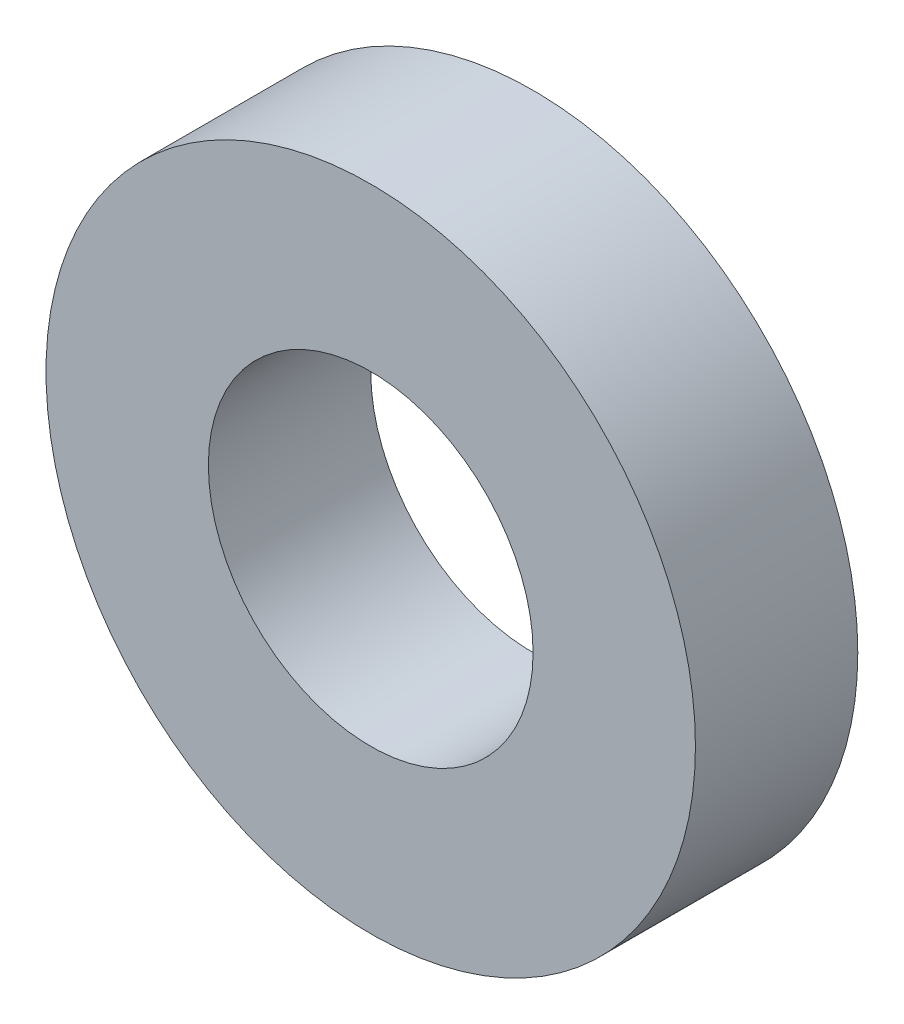
ISO-10303-21;
HEADER;
FILE_DESCRIPTION(('STEP AP214'),'2;1');
FILE_NAME('part.step','',(''),(''),'','','');
FILE_SCHEMA(('AUTOMOTIVE_DESIGN { 1 0 10303 214 1 1 1 1 }'));
ENDSEC;
DATA;
#1=APPLICATION_CONTEXT('core data for automotive mechanical design processes');
#2=APPLICATION_PROTOCOL_DEFINITION('international standard','automotive_design',2000,#1);
#3=PRODUCT_CONTEXT('',#1,'mechanical');
#4=PRODUCT('Part','Part','',(#3));
#5=PRODUCT_RELATED_PRODUCT_CATEGORY('part','',(#4));
#6=PRODUCT_DEFINITION_FORMATION('','',#4);
#7=PRODUCT_DEFINITION_CONTEXT('part definition',#1,'design');
#8=PRODUCT_DEFINITION('design','',#6,#7);
#9=PRODUCT_DEFINITION_SHAPE('','',#8);
#10=(LENGTH_UNIT() NAMED_UNIT(*) SI_UNIT(.MILLI.,.METRE.));
#11=(NAMED_UNIT(*) PLANE_ANGLE_UNIT() SI_UNIT($,.RADIAN.));
#12=(NAMED_UNIT(*) SI_UNIT($,.STERADIAN.) SOLID_ANGLE_UNIT());
#13=UNCERTAINTY_MEASURE_WITH_UNIT(LENGTH_MEASURE(1.E-05),#10,'distance_accuracy_value','');
#14=(GEOMETRIC_REPRESENTATION_CONTEXT(3) GLOBAL_UNCERTAINTY_ASSIGNED_CONTEXT((#13)) GLOBAL_UNIT_ASSIGNED_CONTEXT((#10,
#11,#12)) REPRESENTATION_CONTEXT('',''));
#15=CARTESIAN_POINT('',(0.,0.,0.));
#16=DIRECTION('',(0.,0.,1.));
#17=DIRECTION('',(1.,0.,0.));
#18=AXIS2_PLACEMENT_3D('',#15,#16,#17);
#19=CARTESIAN_POINT('',(0.,0.,-3.175));
#20=DIRECTION('',(0.,0.,-1.));
#21=DIRECTION('',(1.,0.,0.));
#22=AXIS2_PLACEMENT_3D('',#19,#20,#21);
#23=PLANE('',#22);
#24=CARTESIAN_POINT('',(0.,0.,-3.175));
#25=DIRECTION('',(0.,0.,1.));
#26=DIRECTION('',(1.,0.,0.));
#27=AXIS2_PLACEMENT_3D('',#24,#25,#26);
#28=CIRCLE('',#27,6.35);
#29=CARTESIAN_POINT('',(6.35,0.,-3.175));
#30=VERTEX_POINT('',#29);
#31=EDGE_CURVE('E10',#30,#30,#28,.T.);
#32=ORIENTED_EDGE('',*,*,#31,.F.);
#33=EDGE_LOOP('',(#32));
#34=FACE_BOUND('',#33,.T.);
#35=CARTESIAN_POINT('',(0.,0.,-3.175));
#36=DIRECTION('',(0.,0.,1.));
#37=DIRECTION('',(1.,0.,0.));
#38=AXIS2_PLACEMENT_3D('',#35,#36,#37);
#39=CIRCLE('',#38,3.175);
#40=CARTESIAN_POINT('',(3.175,0.,-3.175));
#41=VERTEX_POINT('',#40);
#42=EDGE_CURVE('E41',#41,#41,#39,.T.);
#43=ORIENTED_EDGE('',*,*,#42,.T.);
#44=EDGE_LOOP('',(#43));
#45=FACE_BOUND('',#44,.T.);
#46=ADVANCED_FACE('F30',(#34,#45),#23,.T.);
#47=CARTESIAN_POINT('',(0.,0.,0.));
#48=DIRECTION('',(0.,0.,-1.));
#49=DIRECTION('',(1.,0.,0.));
#50=AXIS2_PLACEMENT_3D('',#47,#48,#49);
#51=PLANE('',#50);
#52=CARTESIAN_POINT('',(0.,0.,0.));
#53=DIRECTION('',(0.,0.,1.));
#54=DIRECTION('',(1.,0.,0.));
#55=AXIS2_PLACEMENT_3D('',#52,#53,#54);
#56=CIRCLE('',#55,6.35);
#57=CARTESIAN_POINT('',(6.35,0.,0.));
#58=VERTEX_POINT('',#57);
#59=EDGE_CURVE('E34',#58,#58,#56,.T.);
#60=ORIENTED_EDGE('',*,*,#59,.T.);
#61=EDGE_LOOP('',(#60));
#62=FACE_BOUND('',#61,.T.);
#63=CARTESIAN_POINT('',(0.,0.,0.));
#64=DIRECTION('',(0.,0.,1.));
#65=DIRECTION('',(1.,0.,0.));
#66=AXIS2_PLACEMENT_3D('',#63,#64,#65);
#67=CIRCLE('',#66,3.175);
#68=CARTESIAN_POINT('',(3.175,0.,0.));
#69=VERTEX_POINT('',#68);
#70=EDGE_CURVE('E43',#69,#69,#67,.T.);
#71=ORIENTED_EDGE('',*,*,#70,.F.);
#72=EDGE_LOOP('',(#71));
#73=FACE_BOUND('',#72,.T.);
#74=ADVANCED_FACE('F56',(#62,#73),#51,.F.);
#75=CARTESIAN_POINT('',(0.,0.,-3.175));
#76=DIRECTION('',(0.,0.,1.));
#77=DIRECTION('',(-1.,0.,0.));
#78=AXIS2_PLACEMENT_3D('',#75,#76,#77);
#79=CYLINDRICAL_SURFACE('',#78,6.35);
#80=ORIENTED_EDGE('',*,*,#31,.T.);
#81=EDGE_LOOP('',(#80));
#82=FACE_BOUND('',#81,.T.);
#83=ORIENTED_EDGE('',*,*,#59,.F.);
#84=EDGE_LOOP('',(#83));
#85=FACE_BOUND('',#84,.T.);
#86=ADVANCED_FACE('F32',(#82,#85),#79,.T.);
#87=CARTESIAN_POINT('',(0.,0.,-3.175));
#88=DIRECTION('',(0.,0.,1.));
#89=DIRECTION('',(-1.,0.,0.));
#90=AXIS2_PLACEMENT_3D('',#87,#88,#89);
#91=CYLINDRICAL_SURFACE('',#90,3.175);
#92=ORIENTED_EDGE('',*,*,#42,.F.);
#93=EDGE_LOOP('',(#92));
#94=FACE_BOUND('',#93,.T.);
#95=ORIENTED_EDGE('',*,*,#70,.T.);
#96=EDGE_LOOP('',(#95));
#97=FACE_BOUND('',#96,.T.);
#98=ADVANCED_FACE('F50',(#94,#97),#91,.F.);
#99=CLOSED_SHELL('',(#46,#74,#86,#98));
#100=MANIFOLD_SOLID_BREP('B2',#99);
#101=ADVANCED_BREP_SHAPE_REPRESENTATION('',(#18,#100),#14);
#102=SHAPE_DEFINITION_REPRESENTATION(#9,#101);
ENDSEC;
END-ISO-10303-21;
